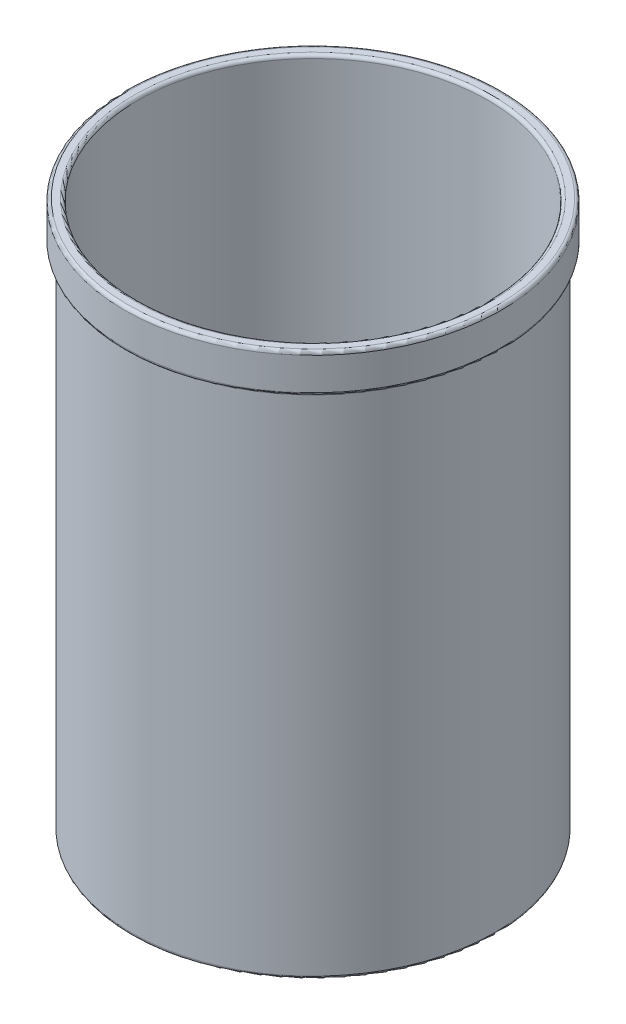
ISO-10303-21;
HEADER;
FILE_DESCRIPTION(('STEP AP214'),'2;1');
FILE_NAME('part.step','',(''),(''),'','','');
FILE_SCHEMA(('AUTOMOTIVE_DESIGN { 1 0 10303 214 1 1 1 1 }'));
ENDSEC;
DATA;
#1=APPLICATION_CONTEXT('core data for automotive mechanical design processes');
#2=APPLICATION_PROTOCOL_DEFINITION('international standard','automotive_design',2000,#1);
#3=PRODUCT_CONTEXT('',#1,'mechanical');
#4=PRODUCT('Part','Part','',(#3));
#5=PRODUCT_RELATED_PRODUCT_CATEGORY('part','',(#4));
#6=PRODUCT_DEFINITION_FORMATION('','',#4);
#7=PRODUCT_DEFINITION_CONTEXT('part definition',#1,'design');
#8=PRODUCT_DEFINITION('design','',#6,#7);
#9=PRODUCT_DEFINITION_SHAPE('','',#8);
#10=(LENGTH_UNIT() NAMED_UNIT(*) SI_UNIT(.MILLI.,.METRE.));
#11=(NAMED_UNIT(*) PLANE_ANGLE_UNIT() SI_UNIT($,.RADIAN.));
#12=(NAMED_UNIT(*) SI_UNIT($,.STERADIAN.) SOLID_ANGLE_UNIT());
#13=UNCERTAINTY_MEASURE_WITH_UNIT(LENGTH_MEASURE(1.E-05),#10,'distance_accuracy_value','');
#14=(GEOMETRIC_REPRESENTATION_CONTEXT(3) GLOBAL_UNCERTAINTY_ASSIGNED_CONTEXT((#13)) GLOBAL_UNIT_ASSIGNED_CONTEXT((#10,
#11,#12)) REPRESENTATION_CONTEXT('',''));
#15=CARTESIAN_POINT('',(0.,0.,0.));
#16=DIRECTION('',(0.,0.,1.));
#17=DIRECTION('',(1.,0.,0.));
#18=AXIS2_PLACEMENT_3D('',#15,#16,#17);
#19=CARTESIAN_POINT('',(0.,169.33,0.));
#20=DIRECTION('',(0.,-1.,0.));
#21=DIRECTION('',(0.,0.,-1.));
#22=AXIS2_PLACEMENT_3D('',#19,#20,#21);
#23=CYLINDRICAL_SURFACE('',#22,56.1);
#24=CARTESIAN_POINT('',(0.,1.,0.));
#25=DIRECTION('',(0.,1.,0.));
#26=DIRECTION('',(0.,0.,1.));
#27=AXIS2_PLACEMENT_3D('',#24,#25,#26);
#28=CIRCLE('',#27,56.1);
#29=CARTESIAN_POINT('',(0.,1.,56.1));
#30=VERTEX_POINT('',#29);
#31=EDGE_CURVE('E104',#30,#30,#28,.T.);
#32=ORIENTED_EDGE('',*,*,#31,.T.);
#33=EDGE_LOOP('',(#32));
#34=FACE_BOUND('',#33,.T.);
#35=CARTESIAN_POINT('',(0.,156.33,0.));
#36=DIRECTION('',(0.,1.,0.));
#37=DIRECTION('',(0.,0.,1.));
#38=AXIS2_PLACEMENT_3D('',#35,#36,#37);
#39=CIRCLE('',#38,56.1);
#40=CARTESIAN_POINT('',(0.,156.33,56.1));
#41=VERTEX_POINT('',#40);
#42=EDGE_CURVE('E106',#41,#41,#39,.F.);
#43=ORIENTED_EDGE('',*,*,#42,.T.);
#44=EDGE_LOOP('',(#43));
#45=FACE_BOUND('',#44,.T.);
#46=ADVANCED_FACE('F37',(#34,#45),#23,.T.);
#47=CARTESIAN_POINT('',(0.,169.33,0.));
#48=DIRECTION('',(0.,1.,0.));
#49=DIRECTION('',(0.,0.,1.));
#50=AXIS2_PLACEMENT_3D('',#47,#48,#49);
#51=PLANE('',#50);
#52=CARTESIAN_POINT('',(0.,169.33,0.));
#53=DIRECTION('',(0.,1.,0.));
#54=DIRECTION('',(0.,0.,1.));
#55=AXIS2_PLACEMENT_3D('',#52,#53,#54);
#56=CIRCLE('',#55,55.1);
#57=CARTESIAN_POINT('',(0.,169.33,55.1));
#58=VERTEX_POINT('',#57);
#59=EDGE_CURVE('E50',#58,#58,#56,.F.);
#60=ORIENTED_EDGE('',*,*,#59,.T.);
#61=EDGE_LOOP('',(#60));
#62=FACE_BOUND('',#61,.T.);
#63=CARTESIAN_POINT('',(0.,169.33,0.));
#64=DIRECTION('',(0.,1.,0.));
#65=DIRECTION('',(0.,0.,1.));
#66=AXIS2_PLACEMENT_3D('',#63,#64,#65);
#67=CIRCLE('',#66,57.1);
#68=CARTESIAN_POINT('',(0.,169.33,57.1));
#69=VERTEX_POINT('',#68);
#70=EDGE_CURVE('E105',#69,#69,#67,.T.);
#71=ORIENTED_EDGE('',*,*,#70,.T.);
#72=EDGE_LOOP('',(#71));
#73=FACE_BOUND('',#72,.T.);
#74=ADVANCED_FACE('F82',(#62,#73),#51,.T.);
#75=CARTESIAN_POINT('',(0.,169.33,0.));
#76=DIRECTION('',(0.,-1.,0.));
#77=DIRECTION('',(0.,0.,-1.));
#78=AXIS2_PLACEMENT_3D('',#75,#76,#77);
#79=CYLINDRICAL_SURFACE('',#78,54.1);
#80=CARTESIAN_POINT('',(0.,1.,0.));
#81=DIRECTION('',(0.,1.,0.));
#82=DIRECTION('',(0.,0.,1.));
#83=AXIS2_PLACEMENT_3D('',#80,#81,#82);
#84=CIRCLE('',#83,54.1);
#85=CARTESIAN_POINT('',(0.,1.,54.1));
#86=VERTEX_POINT('',#85);
#87=EDGE_CURVE('E59',#86,#86,#84,.F.);
#88=ORIENTED_EDGE('',*,*,#87,.T.);
#89=EDGE_LOOP('',(#88));
#90=FACE_BOUND('',#89,.T.);
#91=CARTESIAN_POINT('',(0.,168.33,0.));
#92=DIRECTION('',(0.,1.,0.));
#93=DIRECTION('',(0.,0.,1.));
#94=AXIS2_PLACEMENT_3D('',#91,#92,#93);
#95=CIRCLE('',#94,54.1);
#96=CARTESIAN_POINT('',(0.,168.33,54.1));
#97=VERTEX_POINT('',#96);
#98=EDGE_CURVE('E55',#97,#97,#95,.T.);
#99=ORIENTED_EDGE('',*,*,#98,.T.);
#100=EDGE_LOOP('',(#99));
#101=FACE_BOUND('',#100,.T.);
#102=ADVANCED_FACE('F88',(#90,#101),#79,.F.);
#103=CARTESIAN_POINT('',(0.,157.33,0.));
#104=DIRECTION('',(0.,1.,0.));
#105=DIRECTION('',(0.,0.,1.));
#106=AXIS2_PLACEMENT_3D('',#103,#104,#105);
#107=CYLINDRICAL_SURFACE('',#106,58.1);
#108=CARTESIAN_POINT('',(0.,158.33,0.));
#109=DIRECTION('',(0.,1.,0.));
#110=DIRECTION('',(0.,0.,1.));
#111=AXIS2_PLACEMENT_3D('',#108,#109,#110);
#112=CIRCLE('',#111,58.1);
#113=CARTESIAN_POINT('',(0.,158.33,58.1));
#114=VERTEX_POINT('',#113);
#115=EDGE_CURVE('E10',#114,#114,#112,.T.);
#116=ORIENTED_EDGE('',*,*,#115,.T.);
#117=EDGE_LOOP('',(#116));
#118=FACE_BOUND('',#117,.T.);
#119=CARTESIAN_POINT('',(0.,168.33,0.));
#120=DIRECTION('',(0.,1.,0.));
#121=DIRECTION('',(0.,0.,1.));
#122=AXIS2_PLACEMENT_3D('',#119,#120,#121);
#123=CIRCLE('',#122,58.1);
#124=CARTESIAN_POINT('',(0.,168.33,58.1));
#125=VERTEX_POINT('',#124);
#126=EDGE_CURVE('E45',#125,#125,#123,.F.);
#127=ORIENTED_EDGE('',*,*,#126,.T.);
#128=EDGE_LOOP('',(#127));
#129=FACE_BOUND('',#128,.T.);
#130=ADVANCED_FACE('F96',(#118,#129),#107,.T.);
#131=CARTESIAN_POINT('',(0.,1.,0.));
#132=DIRECTION('',(0.,1.,0.));
#133=DIRECTION('',(0.,0.,1.));
#134=AXIS2_PLACEMENT_3D('',#131,#132,#133);
#135=TOROIDAL_SURFACE('',#134,55.1,1.);
#136=ORIENTED_EDGE('',*,*,#31,.F.);
#137=EDGE_LOOP('',(#136));
#138=FACE_BOUND('',#137,.T.);
#139=CARTESIAN_POINT('',(0.,0.,0.));
#140=DIRECTION('',(0.,1.,0.));
#141=DIRECTION('',(0.,0.,1.));
#142=AXIS2_PLACEMENT_3D('',#139,#140,#141);
#143=CIRCLE('',#142,55.1);
#144=CARTESIAN_POINT('',(0.,0.,55.1));
#145=VERTEX_POINT('',#144);
#146=EDGE_CURVE('E53',#145,#145,#143,.F.);
#147=ORIENTED_EDGE('',*,*,#146,.F.);
#148=EDGE_LOOP('',(#147));
#149=FACE_BOUND('',#148,.T.);
#150=ADVANCED_FACE('F78',(#138,#149),#135,.T.);
#151=CARTESIAN_POINT('',(0.,1.,0.));
#152=DIRECTION('',(0.,1.,0.));
#153=DIRECTION('',(0.,0.,1.));
#154=AXIS2_PLACEMENT_3D('',#151,#152,#153);
#155=TOROIDAL_SURFACE('',#154,55.1,1.);
#156=ORIENTED_EDGE('',*,*,#87,.F.);
#157=EDGE_LOOP('',(#156));
#158=FACE_BOUND('',#157,.T.);
#159=ORIENTED_EDGE('',*,*,#146,.T.);
#160=EDGE_LOOP('',(#159));
#161=FACE_BOUND('',#160,.T.);
#162=ADVANCED_FACE('F68',(#158,#161),#155,.T.);
#163=CARTESIAN_POINT('',(0.,158.33,0.));
#164=DIRECTION('',(0.,1.,0.));
#165=DIRECTION('',(0.,0.,1.));
#166=AXIS2_PLACEMENT_3D('',#163,#164,#165);
#167=TOROIDAL_SURFACE('',#166,57.1,1.);
#168=ORIENTED_EDGE('',*,*,#115,.F.);
#169=EDGE_LOOP('',(#168));
#170=FACE_BOUND('',#169,.T.);
#171=CARTESIAN_POINT('',(0.,157.33,0.));
#172=DIRECTION('',(0.,1.,0.));
#173=DIRECTION('',(0.,0.,1.));
#174=AXIS2_PLACEMENT_3D('',#171,#172,#173);
#175=CIRCLE('',#174,57.1);
#176=CARTESIAN_POINT('',(0.,157.33,57.1));
#177=VERTEX_POINT('',#176);
#178=EDGE_CURVE('E41',#177,#177,#175,.F.);
#179=ORIENTED_EDGE('',*,*,#178,.F.);
#180=EDGE_LOOP('',(#179));
#181=FACE_BOUND('',#180,.T.);
#182=ADVANCED_FACE('F66',(#170,#181),#167,.T.);
#183=CARTESIAN_POINT('',(0.,156.33,0.));
#184=DIRECTION('',(0.,1.,0.));
#185=DIRECTION('',(0.,0.,1.));
#186=AXIS2_PLACEMENT_3D('',#183,#184,#185);
#187=TOROIDAL_SURFACE('',#186,57.1,1.);
#188=ORIENTED_EDGE('',*,*,#42,.F.);
#189=EDGE_LOOP('',(#188));
#190=FACE_BOUND('',#189,.T.);
#191=ORIENTED_EDGE('',*,*,#178,.T.);
#192=EDGE_LOOP('',(#191));
#193=FACE_BOUND('',#192,.T.);
#194=ADVANCED_FACE('F64',(#190,#193),#187,.F.);
#195=CARTESIAN_POINT('',(0.,168.33,0.));
#196=DIRECTION('',(0.,1.,0.));
#197=DIRECTION('',(0.,0.,1.));
#198=AXIS2_PLACEMENT_3D('',#195,#196,#197);
#199=TOROIDAL_SURFACE('',#198,55.1,1.);
#200=ORIENTED_EDGE('',*,*,#59,.F.);
#201=EDGE_LOOP('',(#200));
#202=FACE_BOUND('',#201,.T.);
#203=ORIENTED_EDGE('',*,*,#98,.F.);
#204=EDGE_LOOP('',(#203));
#205=FACE_BOUND('',#204,.T.);
#206=ADVANCED_FACE('F75',(#202,#205),#199,.T.);
#207=CARTESIAN_POINT('',(0.,168.33,0.));
#208=DIRECTION('',(0.,1.,0.));
#209=DIRECTION('',(0.,0.,1.));
#210=AXIS2_PLACEMENT_3D('',#207,#208,#209);
#211=TOROIDAL_SURFACE('',#210,57.1,1.);
#212=ORIENTED_EDGE('',*,*,#126,.F.);
#213=EDGE_LOOP('',(#212));
#214=FACE_BOUND('',#213,.T.);
#215=ORIENTED_EDGE('',*,*,#70,.F.);
#216=EDGE_LOOP('',(#215));
#217=FACE_BOUND('',#216,.T.);
#218=ADVANCED_FACE('F39',(#214,#217),#211,.T.);
#219=CLOSED_SHELL('',(#46,#74,#102,#130,#150,#162,#182,#194,#206,#218));
#220=MANIFOLD_SOLID_BREP('B2',#219);
#221=ADVANCED_BREP_SHAPE_REPRESENTATION('',(#18,#220),#14);
#222=SHAPE_DEFINITION_REPRESENTATION(#9,#221);
ENDSEC;
END-ISO-10303-21;
